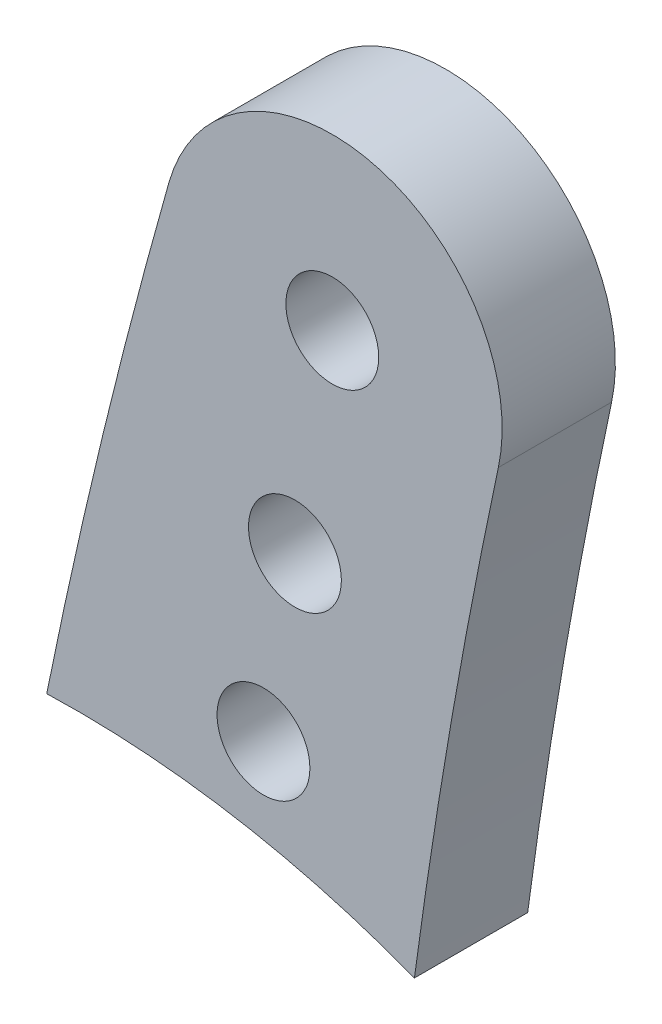
ISO-10303-21;
HEADER;
FILE_DESCRIPTION(('STEP AP214'),'2;1');
FILE_NAME('part.step','',(''),(''),'','','');
FILE_SCHEMA(('AUTOMOTIVE_DESIGN { 1 0 10303 214 1 1 1 1 }'));
ENDSEC;
DATA;
#1=APPLICATION_CONTEXT('core data for automotive mechanical design processes');
#2=APPLICATION_PROTOCOL_DEFINITION('international standard','automotive_design',2000,#1);
#3=PRODUCT_CONTEXT('',#1,'mechanical');
#4=PRODUCT('Part','Part','',(#3));
#5=PRODUCT_RELATED_PRODUCT_CATEGORY('part','',(#4));
#6=PRODUCT_DEFINITION_FORMATION('','',#4);
#7=PRODUCT_DEFINITION_CONTEXT('part definition',#1,'design');
#8=PRODUCT_DEFINITION('design','',#6,#7);
#9=PRODUCT_DEFINITION_SHAPE('','',#8);
#10=(LENGTH_UNIT() NAMED_UNIT(*) SI_UNIT(.MILLI.,.METRE.));
#11=(NAMED_UNIT(*) PLANE_ANGLE_UNIT() SI_UNIT($,.RADIAN.));
#12=(NAMED_UNIT(*) SI_UNIT($,.STERADIAN.) SOLID_ANGLE_UNIT());
#13=UNCERTAINTY_MEASURE_WITH_UNIT(LENGTH_MEASURE(1.E-05),#10,'distance_accuracy_value','');
#14=(GEOMETRIC_REPRESENTATION_CONTEXT(3) GLOBAL_UNCERTAINTY_ASSIGNED_CONTEXT((#13)) GLOBAL_UNIT_ASSIGNED_CONTEXT((#10,
#11,#12)) REPRESENTATION_CONTEXT('',''));
#15=CARTESIAN_POINT('',(0.,0.,0.));
#16=DIRECTION('',(0.,0.,1.));
#17=DIRECTION('',(1.,0.,0.));
#18=AXIS2_PLACEMENT_3D('',#15,#16,#17);
#19=CARTESIAN_POINT('',(132.163561057133,79.5979040435119,5.));
#20=DIRECTION('',(0.,0.,-1.));
#21=DIRECTION('',(-1.,0.,0.));
#22=AXIS2_PLACEMENT_3D('',#19,#20,#21);
#23=PLANE('',#22);
#24=CARTESIAN_POINT('',(-11.5885359364163,78.4071972408224,5.));
#25=DIRECTION('',(0.,0.,-1.));
#26=DIRECTION('',(-1.,0.,0.));
#27=AXIS2_PLACEMENT_3D('',#24,#25,#26);
#28=CIRCLE('',#27,41.4197044064197);
#29=CARTESIAN_POINT('',(-12.9191549616682,119.8055228848,5.));
#30=VERTEX_POINT('',#29);
#31=CARTESIAN_POINT('',(3.31710142451491,117.051910824696,5.));
#32=VERTEX_POINT('',#31);
#33=EDGE_CURVE('E88',#30,#32,#28,.T.);
#34=ORIENTED_EDGE('',*,*,#33,.T.);
#35=CARTESIAN_POINT('',(275.915658050682,80.7886108462014,5.));
#36=DIRECTION('',(0.,0.,-1.));
#37=DIRECTION('',(1.,0.,0.));
#38=AXIS2_PLACEMENT_3D('',#35,#36,#37);
#39=CIRCLE('',#38,275.);
#40=CARTESIAN_POINT('',(7.02397479696329,138.42768333164,5.));
#41=VERTEX_POINT('',#40);
#42=EDGE_CURVE('E83',#32,#41,#39,.T.);
#43=ORIENTED_EDGE('',*,*,#42,.T.);
#44=CARTESIAN_POINT('',(-0.309434746319955,139.999658035789,5.));
#45=DIRECTION('',(0.,0.,1.));
#46=DIRECTION('',(1.,0.,0.));
#47=AXIS2_PLACEMENT_3D('',#44,#45,#46);
#48=CIRCLE('',#47,7.5);
#49=CARTESIAN_POINT('',(-7.52539193567164,142.044153533814,5.));
#50=VERTEX_POINT('',#49);
#51=EDGE_CURVE('E86',#41,#50,#48,.T.);
#52=ORIENTED_EDGE('',*,*,#51,.T.);
#53=CARTESIAN_POINT('',(281.112895638395,60.2643336128175,5.));
#54=DIRECTION('',(0.,0.,1.));
#55=DIRECTION('',(1.,0.,0.));
#56=AXIS2_PLACEMENT_3D('',#53,#54,#55);
#57=CIRCLE('',#56,300.);
#58=EDGE_CURVE('E53',#50,#30,#57,.T.);
#59=ORIENTED_EDGE('',*,*,#58,.T.);
#60=EDGE_LOOP('',(#34,#43,#52,#59));
#61=FACE_BOUND('',#60,.T.);
#62=CARTESIAN_POINT('',(-0.309434746319955,139.999658035789,5.));
#63=DIRECTION('',(0.,0.,1.));
#64=DIRECTION('',(1.,0.,0.));
#65=AXIS2_PLACEMENT_3D('',#62,#63,#64);
#66=CIRCLE('',#65,2.05);
#67=CARTESIAN_POINT('',(1.74056525368004,139.999658035789,5.));
#68=VERTEX_POINT('',#67);
#69=EDGE_CURVE('E103',#68,#68,#66,.T.);
#70=ORIENTED_EDGE('',*,*,#69,.F.);
#71=EDGE_LOOP('',(#70));
#72=FACE_BOUND('',#71,.T.);
#73=CARTESIAN_POINT('',(-1.95909243415583,130.643984382173,5.));
#74=DIRECTION('',(0.,0.,1.));
#75=DIRECTION('',(1.,0.,0.));
#76=AXIS2_PLACEMENT_3D('',#73,#74,#75);
#77=CIRCLE('',#76,2.05);
#78=CARTESIAN_POINT('',(0.090907565844173,130.643984382173,5.));
#79=VERTEX_POINT('',#78);
#80=EDGE_CURVE('E118',#79,#79,#77,.T.);
#81=ORIENTED_EDGE('',*,*,#80,.F.);
#82=EDGE_LOOP('',(#81));
#83=FACE_BOUND('',#82,.T.);
#84=CARTESIAN_POINT('',(-3.34827785549124,122.765522358075,5.));
#85=DIRECTION('',(0.,0.,1.));
#86=DIRECTION('',(1.,0.,0.));
#87=AXIS2_PLACEMENT_3D('',#84,#85,#86);
#88=CIRCLE('',#87,2.05);
#89=CARTESIAN_POINT('',(-1.29827785549124,122.765522358075,5.));
#90=VERTEX_POINT('',#89);
#91=EDGE_CURVE('E124',#90,#90,#88,.T.);
#92=ORIENTED_EDGE('',*,*,#91,.F.);
#93=EDGE_LOOP('',(#92));
#94=FACE_BOUND('',#93,.T.);
#95=ADVANCED_FACE('F36',(#61,#72,#83,#94),#23,.F.);
#96=CARTESIAN_POINT('',(132.163561057133,79.5979040435119,0.));
#97=DIRECTION('',(0.,0.,-1.));
#98=DIRECTION('',(-1.,0.,0.));
#99=AXIS2_PLACEMENT_3D('',#96,#97,#98);
#100=PLANE('',#99);
#101=CARTESIAN_POINT('',(-1.95909243415583,130.643984382173,0.));
#102=DIRECTION('',(0.,0.,1.));
#103=DIRECTION('',(1.,0.,0.));
#104=AXIS2_PLACEMENT_3D('',#101,#102,#103);
#105=CIRCLE('',#104,2.05);
#106=CARTESIAN_POINT('',(0.090907565844173,130.643984382173,0.));
#107=VERTEX_POINT('',#106);
#108=EDGE_CURVE('E121',#107,#107,#105,.T.);
#109=ORIENTED_EDGE('',*,*,#108,.T.);
#110=EDGE_LOOP('',(#109));
#111=FACE_BOUND('',#110,.T.);
#112=CARTESIAN_POINT('',(-11.5885359364163,78.4071972408224,0.));
#113=DIRECTION('',(0.,0.,-1.));
#114=DIRECTION('',(-1.,0.,0.));
#115=AXIS2_PLACEMENT_3D('',#112,#113,#114);
#116=CIRCLE('',#115,41.4197044064197);
#117=CARTESIAN_POINT('',(-12.9191549616682,119.8055228848,0.));
#118=VERTEX_POINT('',#117);
#119=CARTESIAN_POINT('',(3.31710142451491,117.051910824696,0.));
#120=VERTEX_POINT('',#119);
#121=EDGE_CURVE('E100',#118,#120,#116,.T.);
#122=ORIENTED_EDGE('',*,*,#121,.F.);
#123=CARTESIAN_POINT('',(281.112895638395,60.2643336128175,0.));
#124=DIRECTION('',(0.,0.,1.));
#125=DIRECTION('',(1.,0.,0.));
#126=AXIS2_PLACEMENT_3D('',#123,#124,#125);
#127=CIRCLE('',#126,300.);
#128=CARTESIAN_POINT('',(-7.52539193567164,142.044153533814,0.));
#129=VERTEX_POINT('',#128);
#130=EDGE_CURVE('E76',#129,#118,#127,.T.);
#131=ORIENTED_EDGE('',*,*,#130,.F.);
#132=CARTESIAN_POINT('',(-0.309434746319955,139.999658035789,0.));
#133=DIRECTION('',(0.,0.,1.));
#134=DIRECTION('',(1.,0.,0.));
#135=AXIS2_PLACEMENT_3D('',#132,#133,#134);
#136=CIRCLE('',#135,7.5);
#137=CARTESIAN_POINT('',(7.02397479696329,138.42768333164,0.));
#138=VERTEX_POINT('',#137);
#139=EDGE_CURVE('E70',#138,#129,#136,.T.);
#140=ORIENTED_EDGE('',*,*,#139,.F.);
#141=CARTESIAN_POINT('',(275.915658050682,80.7886108462014,0.));
#142=DIRECTION('',(0.,0.,-1.));
#143=DIRECTION('',(1.,0.,0.));
#144=AXIS2_PLACEMENT_3D('',#141,#142,#143);
#145=CIRCLE('',#144,275.);
#146=EDGE_CURVE('E92',#120,#138,#145,.T.);
#147=ORIENTED_EDGE('',*,*,#146,.F.);
#148=EDGE_LOOP('',(#122,#131,#140,#147));
#149=FACE_BOUND('',#148,.T.);
#150=CARTESIAN_POINT('',(-0.309434746319955,139.999658035789,0.));
#151=DIRECTION('',(0.,0.,1.));
#152=DIRECTION('',(1.,0.,0.));
#153=AXIS2_PLACEMENT_3D('',#150,#151,#152);
#154=CIRCLE('',#153,2.05);
#155=CARTESIAN_POINT('',(1.74056525368004,139.999658035789,0.));
#156=VERTEX_POINT('',#155);
#157=EDGE_CURVE('E115',#156,#156,#154,.T.);
#158=ORIENTED_EDGE('',*,*,#157,.T.);
#159=EDGE_LOOP('',(#158));
#160=FACE_BOUND('',#159,.T.);
#161=CARTESIAN_POINT('',(-3.34827785549124,122.765522358075,0.));
#162=DIRECTION('',(0.,0.,1.));
#163=DIRECTION('',(1.,0.,0.));
#164=AXIS2_PLACEMENT_3D('',#161,#162,#163);
#165=CIRCLE('',#164,2.05);
#166=CARTESIAN_POINT('',(-1.29827785549124,122.765522358075,0.));
#167=VERTEX_POINT('',#166);
#168=EDGE_CURVE('E127',#167,#167,#165,.T.);
#169=ORIENTED_EDGE('',*,*,#168,.T.);
#170=EDGE_LOOP('',(#169));
#171=FACE_BOUND('',#170,.T.);
#172=ADVANCED_FACE('F111',(#111,#149,#160,#171),#100,.T.);
#173=CARTESIAN_POINT('',(-11.5885359364163,78.4071972408224,5.));
#174=DIRECTION('',(0.,0.,-1.));
#175=DIRECTION('',(-1.,0.,0.));
#176=AXIS2_PLACEMENT_3D('',#173,#174,#175);
#177=CYLINDRICAL_SURFACE('',#176,41.4197044064197);
#178=ORIENTED_EDGE('',*,*,#121,.T.);
#179=DIRECTION('',(0.,0.,-1.));
#180=VECTOR('',#179,1.);
#181=CARTESIAN_POINT('',(3.31710142451491,117.051910824696,5.));
#182=LINE('',#181,#180);
#183=EDGE_CURVE('E11',#32,#120,#182,.T.);
#184=ORIENTED_EDGE('',*,*,#183,.F.);
#185=ORIENTED_EDGE('',*,*,#33,.F.);
#186=DIRECTION('',(0.,0.,-1.));
#187=VECTOR('',#186,1.);
#188=CARTESIAN_POINT('',(-12.9191549616682,119.8055228848,5.));
#189=LINE('',#188,#187);
#190=EDGE_CURVE('E96',#30,#118,#189,.T.);
#191=ORIENTED_EDGE('',*,*,#190,.T.);
#192=EDGE_LOOP('',(#178,#184,#185,#191));
#193=FACE_BOUND('',#192,.T.);
#194=ADVANCED_FACE('F38',(#193),#177,.F.);
#195=CARTESIAN_POINT('',(275.915658050682,80.7886108462014,5.));
#196=DIRECTION('',(0.,0.,-1.));
#197=DIRECTION('',(-1.,0.,0.));
#198=AXIS2_PLACEMENT_3D('',#195,#196,#197);
#199=CYLINDRICAL_SURFACE('',#198,275.);
#200=ORIENTED_EDGE('',*,*,#146,.T.);
#201=DIRECTION('',(0.,0.,-1.));
#202=VECTOR('',#201,1.);
#203=CARTESIAN_POINT('',(7.02397479696329,138.42768333164,5.));
#204=LINE('',#203,#202);
#205=EDGE_CURVE('E45',#41,#138,#204,.T.);
#206=ORIENTED_EDGE('',*,*,#205,.F.);
#207=ORIENTED_EDGE('',*,*,#42,.F.);
#208=ORIENTED_EDGE('',*,*,#183,.T.);
#209=EDGE_LOOP('',(#200,#206,#207,#208));
#210=FACE_BOUND('',#209,.T.);
#211=ADVANCED_FACE('F91',(#210),#199,.F.);
#212=CARTESIAN_POINT('',(-0.309434746319955,139.999658035789,5.));
#213=DIRECTION('',(0.,0.,-1.));
#214=DIRECTION('',(-1.,0.,0.));
#215=AXIS2_PLACEMENT_3D('',#212,#213,#214);
#216=CYLINDRICAL_SURFACE('',#215,7.5);
#217=ORIENTED_EDGE('',*,*,#139,.T.);
#218=DIRECTION('',(0.,0.,-1.));
#219=VECTOR('',#218,1.);
#220=CARTESIAN_POINT('',(-7.52539193567164,142.044153533814,5.));
#221=LINE('',#220,#219);
#222=EDGE_CURVE('E93',#50,#129,#221,.T.);
#223=ORIENTED_EDGE('',*,*,#222,.F.);
#224=ORIENTED_EDGE('',*,*,#51,.F.);
#225=ORIENTED_EDGE('',*,*,#205,.T.);
#226=EDGE_LOOP('',(#217,#223,#224,#225));
#227=FACE_BOUND('',#226,.T.);
#228=ADVANCED_FACE('F94',(#227),#216,.T.);
#229=CARTESIAN_POINT('',(281.112895638395,60.2643336128175,5.));
#230=DIRECTION('',(0.,0.,-1.));
#231=DIRECTION('',(-1.,0.,0.));
#232=AXIS2_PLACEMENT_3D('',#229,#230,#231);
#233=CYLINDRICAL_SURFACE('',#232,300.);
#234=ORIENTED_EDGE('',*,*,#130,.T.);
#235=ORIENTED_EDGE('',*,*,#190,.F.);
#236=ORIENTED_EDGE('',*,*,#58,.F.);
#237=ORIENTED_EDGE('',*,*,#222,.T.);
#238=EDGE_LOOP('',(#234,#235,#236,#237));
#239=FACE_BOUND('',#238,.T.);
#240=ADVANCED_FACE('F108',(#239),#233,.T.);
#241=CARTESIAN_POINT('',(-0.309434746319955,139.999658035789,5.));
#242=DIRECTION('',(0.,0.,-1.));
#243=DIRECTION('',(-1.,0.,0.));
#244=AXIS2_PLACEMENT_3D('',#241,#242,#243);
#245=CYLINDRICAL_SURFACE('',#244,2.05);
#246=ORIENTED_EDGE('',*,*,#69,.T.);
#247=EDGE_LOOP('',(#246));
#248=FACE_BOUND('',#247,.T.);
#249=ORIENTED_EDGE('',*,*,#157,.F.);
#250=EDGE_LOOP('',(#249));
#251=FACE_BOUND('',#250,.T.);
#252=ADVANCED_FACE('F144',(#248,#251),#245,.F.);
#253=CARTESIAN_POINT('',(-1.95909243415583,130.643984382173,5.));
#254=DIRECTION('',(0.,0.,-1.));
#255=DIRECTION('',(-1.,0.,0.));
#256=AXIS2_PLACEMENT_3D('',#253,#254,#255);
#257=CYLINDRICAL_SURFACE('',#256,2.05);
#258=ORIENTED_EDGE('',*,*,#80,.T.);
#259=EDGE_LOOP('',(#258));
#260=FACE_BOUND('',#259,.T.);
#261=ORIENTED_EDGE('',*,*,#108,.F.);
#262=EDGE_LOOP('',(#261));
#263=FACE_BOUND('',#262,.T.);
#264=ADVANCED_FACE('F198',(#260,#263),#257,.F.);
#265=CARTESIAN_POINT('',(-3.34827785549124,122.765522358075,5.));
#266=DIRECTION('',(0.,0.,-1.));
#267=DIRECTION('',(-1.,0.,0.));
#268=AXIS2_PLACEMENT_3D('',#265,#266,#267);
#269=CYLINDRICAL_SURFACE('',#268,2.05);
#270=ORIENTED_EDGE('',*,*,#91,.T.);
#271=EDGE_LOOP('',(#270));
#272=FACE_BOUND('',#271,.T.);
#273=ORIENTED_EDGE('',*,*,#168,.F.);
#274=EDGE_LOOP('',(#273));
#275=FACE_BOUND('',#274,.T.);
#276=ADVANCED_FACE('F133',(#272,#275),#269,.F.);
#277=CLOSED_SHELL('',(#95,#172,#194,#211,#228,#240,#252,#264,#276));
#278=MANIFOLD_SOLID_BREP('B2',#277);
#279=ADVANCED_BREP_SHAPE_REPRESENTATION('',(#18,#278),#14);
#280=SHAPE_DEFINITION_REPRESENTATION(#9,#279);
ENDSEC;
END-ISO-10303-21;
